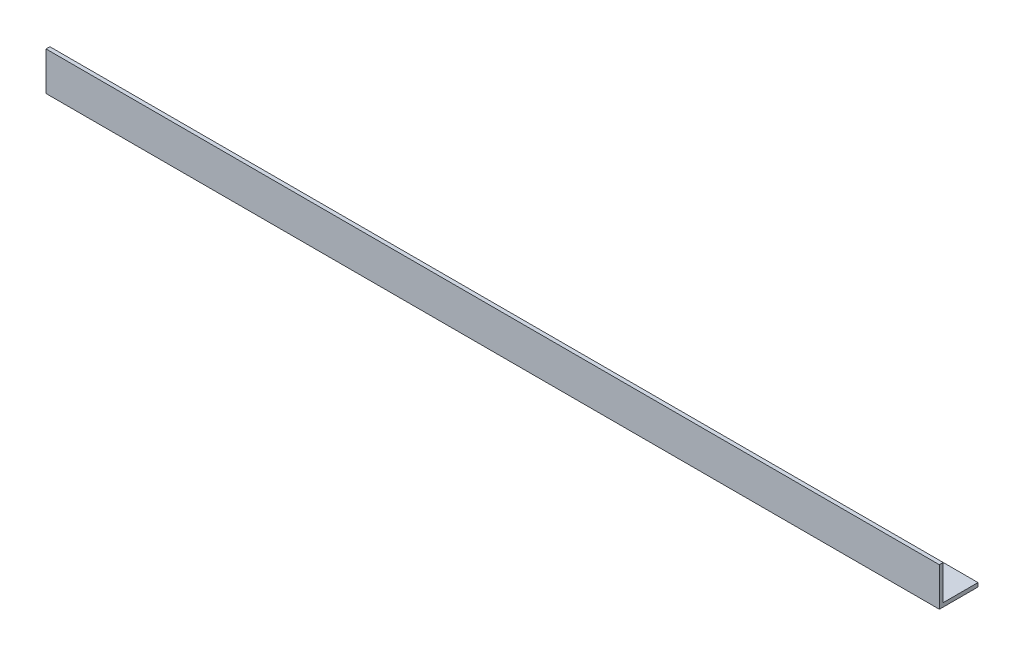
ISO-10303-21;
HEADER;
FILE_DESCRIPTION(('STEP AP214'),'2;1');
FILE_NAME('part.step','',(''),(''),'','','');
FILE_SCHEMA(('AUTOMOTIVE_DESIGN { 1 0 10303 214 1 1 1 1 }'));
ENDSEC;
DATA;
#1=APPLICATION_CONTEXT('core data for automotive mechanical design processes');
#2=APPLICATION_PROTOCOL_DEFINITION('international standard','automotive_design',2000,#1);
#3=PRODUCT_CONTEXT('',#1,'mechanical');
#4=PRODUCT('Part','Part','',(#3));
#5=PRODUCT_RELATED_PRODUCT_CATEGORY('part','',(#4));
#6=PRODUCT_DEFINITION_FORMATION('','',#4);
#7=PRODUCT_DEFINITION_CONTEXT('part definition',#1,'design');
#8=PRODUCT_DEFINITION('design','',#6,#7);
#9=PRODUCT_DEFINITION_SHAPE('','',#8);
#10=(LENGTH_UNIT() NAMED_UNIT(*) SI_UNIT(.MILLI.,.METRE.));
#11=(NAMED_UNIT(*) PLANE_ANGLE_UNIT() SI_UNIT($,.RADIAN.));
#12=(NAMED_UNIT(*) SI_UNIT($,.STERADIAN.) SOLID_ANGLE_UNIT());
#13=UNCERTAINTY_MEASURE_WITH_UNIT(LENGTH_MEASURE(1.E-05),#10,'distance_accuracy_value','');
#14=(GEOMETRIC_REPRESENTATION_CONTEXT(3) GLOBAL_UNCERTAINTY_ASSIGNED_CONTEXT((#13)) GLOBAL_UNIT_ASSIGNED_CONTEXT((#10,
#11,#12)) REPRESENTATION_CONTEXT('',''));
#15=CARTESIAN_POINT('',(0.,0.,0.));
#16=DIRECTION('',(0.,0.,1.));
#17=DIRECTION('',(1.,0.,0.));
#18=AXIS2_PLACEMENT_3D('',#15,#16,#17);
#19=CARTESIAN_POINT('',(347.,0.,-15.));
#20=DIRECTION('',(0.,1.,0.));
#21=DIRECTION('',(0.,0.,1.));
#22=AXIS2_PLACEMENT_3D('',#19,#20,#21);
#23=PLANE('',#22);
#24=DIRECTION('',(0.,0.,-1.));
#25=VECTOR('',#24,1.);
#26=CARTESIAN_POINT('',(0.,0.,-15.));
#27=LINE('',#26,#25);
#28=CARTESIAN_POINT('',(0.,0.,0.));
#29=VERTEX_POINT('',#28);
#30=CARTESIAN_POINT('',(0.,0.,-15.));
#31=VERTEX_POINT('',#30);
#32=EDGE_CURVE('E119',#29,#31,#27,.T.);
#33=ORIENTED_EDGE('',*,*,#32,.T.);
#34=DIRECTION('',(-1.,0.,0.));
#35=VECTOR('',#34,1.);
#36=CARTESIAN_POINT('',(347.,0.,-15.));
#37=LINE('',#36,#35);
#38=CARTESIAN_POINT('',(347.,0.,-15.));
#39=VERTEX_POINT('',#38);
#40=EDGE_CURVE('E11',#39,#31,#37,.T.);
#41=ORIENTED_EDGE('',*,*,#40,.F.);
#42=DIRECTION('',(0.,0.,-1.));
#43=VECTOR('',#42,1.);
#44=CARTESIAN_POINT('',(347.,0.,-15.));
#45=LINE('',#44,#43);
#46=CARTESIAN_POINT('',(347.,0.,0.));
#47=VERTEX_POINT('',#46);
#48=EDGE_CURVE('E129',#47,#39,#45,.T.);
#49=ORIENTED_EDGE('',*,*,#48,.F.);
#50=DIRECTION('',(-1.,0.,0.));
#51=VECTOR('',#50,1.);
#52=CARTESIAN_POINT('',(347.,0.,0.));
#53=LINE('',#52,#51);
#54=EDGE_CURVE('E115',#47,#29,#53,.T.);
#55=ORIENTED_EDGE('',*,*,#54,.T.);
#56=EDGE_LOOP('',(#33,#41,#49,#55));
#57=FACE_BOUND('',#56,.T.);
#58=ADVANCED_FACE('F35',(#57),#23,.F.);
#59=CARTESIAN_POINT('',(347.,1.49999999999998,-15.));
#60=DIRECTION('',(0.,0.,1.));
#61=DIRECTION('',(1.,0.,0.));
#62=AXIS2_PLACEMENT_3D('',#59,#60,#61);
#63=PLANE('',#62);
#64=DIRECTION('',(0.,1.,0.));
#65=VECTOR('',#64,1.);
#66=CARTESIAN_POINT('',(0.,1.49999999999998,-15.));
#67=LINE('',#66,#65);
#68=CARTESIAN_POINT('',(0.,1.49999999999998,-15.));
#69=VERTEX_POINT('',#68);
#70=EDGE_CURVE('E122',#31,#69,#67,.T.);
#71=ORIENTED_EDGE('',*,*,#70,.T.);
#72=DIRECTION('',(-1.,0.,0.));
#73=VECTOR('',#72,1.);
#74=CARTESIAN_POINT('',(347.,1.49999999999998,-15.));
#75=LINE('',#74,#73);
#76=CARTESIAN_POINT('',(347.,1.49999999999998,-15.));
#77=VERTEX_POINT('',#76);
#78=EDGE_CURVE('E43',#77,#69,#75,.T.);
#79=ORIENTED_EDGE('',*,*,#78,.F.);
#80=DIRECTION('',(0.,1.,0.));
#81=VECTOR('',#80,1.);
#82=CARTESIAN_POINT('',(347.,1.49999999999998,-15.));
#83=LINE('',#82,#81);
#84=EDGE_CURVE('E88',#39,#77,#83,.T.);
#85=ORIENTED_EDGE('',*,*,#84,.F.);
#86=ORIENTED_EDGE('',*,*,#40,.T.);
#87=EDGE_LOOP('',(#71,#79,#85,#86));
#88=FACE_BOUND('',#87,.T.);
#89=ADVANCED_FACE('F153',(#88),#63,.F.);
#90=CARTESIAN_POINT('',(347.,1.5,-1.50000000000002));
#91=DIRECTION('',(0.,-1.,0.));
#92=DIRECTION('',(0.,0.,-1.));
#93=AXIS2_PLACEMENT_3D('',#90,#91,#92);
#94=PLANE('',#93);
#95=DIRECTION('',(0.,0.,1.));
#96=VECTOR('',#95,1.);
#97=CARTESIAN_POINT('',(0.,1.5,-1.50000000000002));
#98=LINE('',#97,#96);
#99=CARTESIAN_POINT('',(0.,1.5,-1.50000000000002));
#100=VERTEX_POINT('',#99);
#101=EDGE_CURVE('E124',#69,#100,#98,.T.);
#102=ORIENTED_EDGE('',*,*,#101,.T.);
#103=DIRECTION('',(-1.,0.,0.));
#104=VECTOR('',#103,1.);
#105=CARTESIAN_POINT('',(347.,1.5,-1.50000000000002));
#106=LINE('',#105,#104);
#107=CARTESIAN_POINT('',(347.,1.5,-1.50000000000002));
#108=VERTEX_POINT('',#107);
#109=EDGE_CURVE('E110',#108,#100,#106,.T.);
#110=ORIENTED_EDGE('',*,*,#109,.F.);
#111=DIRECTION('',(0.,0.,1.));
#112=VECTOR('',#111,1.);
#113=CARTESIAN_POINT('',(347.,1.5,-1.50000000000002));
#114=LINE('',#113,#112);
#115=EDGE_CURVE('E101',#77,#108,#114,.T.);
#116=ORIENTED_EDGE('',*,*,#115,.F.);
#117=ORIENTED_EDGE('',*,*,#78,.T.);
#118=EDGE_LOOP('',(#102,#110,#116,#117));
#119=FACE_BOUND('',#118,.T.);
#120=ADVANCED_FACE('F135',(#119),#94,.F.);
#121=CARTESIAN_POINT('',(347.,15.,-1.5));
#122=DIRECTION('',(0.,0.,1.));
#123=DIRECTION('',(0.,-1.,0.));
#124=AXIS2_PLACEMENT_3D('',#121,#122,#123);
#125=PLANE('',#124);
#126=DIRECTION('',(0.,1.,0.));
#127=VECTOR('',#126,1.);
#128=CARTESIAN_POINT('',(0.,15.,-1.5));
#129=LINE('',#128,#127);
#130=CARTESIAN_POINT('',(0.,15.,-1.5));
#131=VERTEX_POINT('',#130);
#132=EDGE_CURVE('E109',#100,#131,#129,.T.);
#133=ORIENTED_EDGE('',*,*,#132,.T.);
#134=DIRECTION('',(-1.,0.,0.));
#135=VECTOR('',#134,1.);
#136=CARTESIAN_POINT('',(347.,15.,-1.5));
#137=LINE('',#136,#135);
#138=CARTESIAN_POINT('',(347.,15.,-1.5));
#139=VERTEX_POINT('',#138);
#140=EDGE_CURVE('E106',#139,#131,#137,.T.);
#141=ORIENTED_EDGE('',*,*,#140,.F.);
#142=DIRECTION('',(0.,1.,0.));
#143=VECTOR('',#142,1.);
#144=CARTESIAN_POINT('',(347.,15.,-1.5));
#145=LINE('',#144,#143);
#146=EDGE_CURVE('E95',#108,#139,#145,.T.);
#147=ORIENTED_EDGE('',*,*,#146,.F.);
#148=ORIENTED_EDGE('',*,*,#109,.T.);
#149=EDGE_LOOP('',(#133,#141,#147,#148));
#150=FACE_BOUND('',#149,.T.);
#151=ADVANCED_FACE('F107',(#150),#125,.F.);
#152=CARTESIAN_POINT('',(347.,15.,0.));
#153=DIRECTION('',(0.,-1.,0.));
#154=DIRECTION('',(0.,0.,-1.));
#155=AXIS2_PLACEMENT_3D('',#152,#153,#154);
#156=PLANE('',#155);
#157=DIRECTION('',(0.,0.,1.));
#158=VECTOR('',#157,1.);
#159=CARTESIAN_POINT('',(0.,15.,0.));
#160=LINE('',#159,#158);
#161=CARTESIAN_POINT('',(0.,15.,0.));
#162=VERTEX_POINT('',#161);
#163=EDGE_CURVE('E74',#131,#162,#160,.T.);
#164=ORIENTED_EDGE('',*,*,#163,.T.);
#165=DIRECTION('',(-1.,0.,0.));
#166=VECTOR('',#165,1.);
#167=CARTESIAN_POINT('',(347.,15.,0.));
#168=LINE('',#167,#166);
#169=CARTESIAN_POINT('',(347.,15.,0.));
#170=VERTEX_POINT('',#169);
#171=EDGE_CURVE('E111',#170,#162,#168,.T.);
#172=ORIENTED_EDGE('',*,*,#171,.F.);
#173=DIRECTION('',(0.,0.,1.));
#174=VECTOR('',#173,1.);
#175=CARTESIAN_POINT('',(347.,15.,0.));
#176=LINE('',#175,#174);
#177=EDGE_CURVE('E99',#139,#170,#176,.T.);
#178=ORIENTED_EDGE('',*,*,#177,.F.);
#179=ORIENTED_EDGE('',*,*,#140,.T.);
#180=EDGE_LOOP('',(#164,#172,#178,#179));
#181=FACE_BOUND('',#180,.T.);
#182=ADVANCED_FACE('F113',(#181),#156,.F.);
#183=CARTESIAN_POINT('',(347.,0.,0.));
#184=DIRECTION('',(0.,0.,-1.));
#185=DIRECTION('',(-1.,0.,0.));
#186=AXIS2_PLACEMENT_3D('',#183,#184,#185);
#187=PLANE('',#186);
#188=DIRECTION('',(0.,-1.,0.));
#189=VECTOR('',#188,1.);
#190=CARTESIAN_POINT('',(0.,0.,0.));
#191=LINE('',#190,#189);
#192=EDGE_CURVE('E80',#162,#29,#191,.T.);
#193=ORIENTED_EDGE('',*,*,#192,.T.);
#194=ORIENTED_EDGE('',*,*,#54,.F.);
#195=DIRECTION('',(0.,-1.,0.));
#196=VECTOR('',#195,1.);
#197=CARTESIAN_POINT('',(347.,0.,0.));
#198=LINE('',#197,#196);
#199=EDGE_CURVE('E51',#170,#47,#198,.T.);
#200=ORIENTED_EDGE('',*,*,#199,.F.);
#201=ORIENTED_EDGE('',*,*,#171,.T.);
#202=EDGE_LOOP('',(#193,#194,#200,#201));
#203=FACE_BOUND('',#202,.T.);
#204=ADVANCED_FACE('F142',(#203),#187,.F.);
#205=CARTESIAN_POINT('',(347.,0.,0.));
#206=DIRECTION('',(-1.,0.,0.));
#207=DIRECTION('',(0.,0.,1.));
#208=AXIS2_PLACEMENT_3D('',#205,#206,#207);
#209=PLANE('',#208);
#210=ORIENTED_EDGE('',*,*,#48,.T.);
#211=ORIENTED_EDGE('',*,*,#84,.T.);
#212=ORIENTED_EDGE('',*,*,#115,.T.);
#213=ORIENTED_EDGE('',*,*,#146,.T.);
#214=ORIENTED_EDGE('',*,*,#177,.T.);
#215=ORIENTED_EDGE('',*,*,#199,.T.);
#216=EDGE_LOOP('',(#210,#211,#212,#213,#214,#215));
#217=FACE_BOUND('',#216,.T.);
#218=ADVANCED_FACE('F97',(#217),#209,.F.);
#219=CARTESIAN_POINT('',(0.,0.,0.));
#220=DIRECTION('',(-1.,0.,0.));
#221=DIRECTION('',(0.,0.,1.));
#222=AXIS2_PLACEMENT_3D('',#219,#220,#221);
#223=PLANE('',#222);
#224=ORIENTED_EDGE('',*,*,#32,.F.);
#225=ORIENTED_EDGE('',*,*,#192,.F.);
#226=ORIENTED_EDGE('',*,*,#163,.F.);
#227=ORIENTED_EDGE('',*,*,#132,.F.);
#228=ORIENTED_EDGE('',*,*,#101,.F.);
#229=ORIENTED_EDGE('',*,*,#70,.F.);
#230=EDGE_LOOP('',(#224,#225,#226,#227,#228,#229));
#231=FACE_BOUND('',#230,.T.);
#232=ADVANCED_FACE('F138',(#231),#223,.T.);
#233=CLOSED_SHELL('',(#58,#89,#120,#151,#182,#204,#218,#232));
#234=MANIFOLD_SOLID_BREP('B2',#233);
#235=ADVANCED_BREP_SHAPE_REPRESENTATION('',(#18,#234),#14);
#236=SHAPE_DEFINITION_REPRESENTATION(#9,#235);
ENDSEC;
END-ISO-10303-21;
